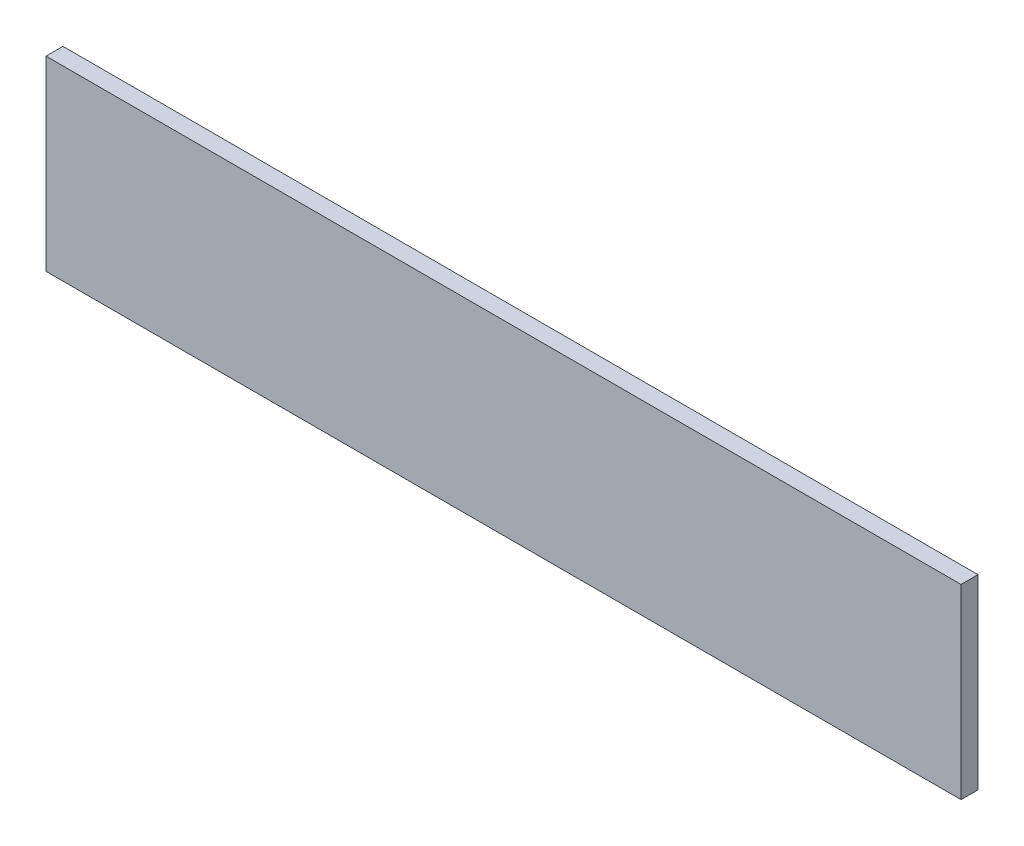
ISO-10303-21;
HEADER;
FILE_DESCRIPTION(('STEP AP214'),'2;1');
FILE_NAME('part.step','',(''),(''),'','','');
FILE_SCHEMA(('AUTOMOTIVE_DESIGN { 1 0 10303 214 1 1 1 1 }'));
ENDSEC;
DATA;
#1=APPLICATION_CONTEXT('core data for automotive mechanical design processes');
#2=APPLICATION_PROTOCOL_DEFINITION('international standard','automotive_design',2000,#1);
#3=PRODUCT_CONTEXT('',#1,'mechanical');
#4=PRODUCT('Part','Part','',(#3));
#5=PRODUCT_RELATED_PRODUCT_CATEGORY('part','',(#4));
#6=PRODUCT_DEFINITION_FORMATION('','',#4);
#7=PRODUCT_DEFINITION_CONTEXT('part definition',#1,'design');
#8=PRODUCT_DEFINITION('design','',#6,#7);
#9=PRODUCT_DEFINITION_SHAPE('','',#8);
#10=(LENGTH_UNIT() NAMED_UNIT(*) SI_UNIT(.MILLI.,.METRE.));
#11=(NAMED_UNIT(*) PLANE_ANGLE_UNIT() SI_UNIT($,.RADIAN.));
#12=(NAMED_UNIT(*) SI_UNIT($,.STERADIAN.) SOLID_ANGLE_UNIT());
#13=UNCERTAINTY_MEASURE_WITH_UNIT(LENGTH_MEASURE(1.E-05),#10,'distance_accuracy_value','');
#14=(GEOMETRIC_REPRESENTATION_CONTEXT(3) GLOBAL_UNCERTAINTY_ASSIGNED_CONTEXT((#13)) GLOBAL_UNIT_ASSIGNED_CONTEXT((#10,
#11,#12)) REPRESENTATION_CONTEXT('',''));
#15=CARTESIAN_POINT('',(0.,0.,0.));
#16=DIRECTION('',(0.,0.,1.));
#17=DIRECTION('',(1.,0.,0.));
#18=AXIS2_PLACEMENT_3D('',#15,#16,#17);
#19=CARTESIAN_POINT('',(342.9,69.85,12.7));
#20=DIRECTION('',(-1.,0.,0.));
#21=DIRECTION('',(0.,0.,1.));
#22=AXIS2_PLACEMENT_3D('',#19,#20,#21);
#23=PLANE('',#22);
#24=DIRECTION('',(0.,1.,0.));
#25=VECTOR('',#24,1.);
#26=CARTESIAN_POINT('',(342.9,69.85,0.));
#27=LINE('',#26,#25);
#28=CARTESIAN_POINT('',(342.9,-69.85,0.));
#29=VERTEX_POINT('',#28);
#30=CARTESIAN_POINT('',(342.9,69.85,0.));
#31=VERTEX_POINT('',#30);
#32=EDGE_CURVE('E107',#29,#31,#27,.T.);
#33=ORIENTED_EDGE('',*,*,#32,.T.);
#34=DIRECTION('',(0.,0.,-1.));
#35=VECTOR('',#34,1.);
#36=CARTESIAN_POINT('',(342.9,69.85,12.7));
#37=LINE('',#36,#35);
#38=CARTESIAN_POINT('',(342.9,69.85,12.7));
#39=VERTEX_POINT('',#38);
#40=EDGE_CURVE('E11',#39,#31,#37,.T.);
#41=ORIENTED_EDGE('',*,*,#40,.F.);
#42=DIRECTION('',(0.,1.,0.));
#43=VECTOR('',#42,1.);
#44=CARTESIAN_POINT('',(342.9,69.85,12.7));
#45=LINE('',#44,#43);
#46=CARTESIAN_POINT('',(342.9,-69.85,12.7));
#47=VERTEX_POINT('',#46);
#48=EDGE_CURVE('E91',#47,#39,#45,.T.);
#49=ORIENTED_EDGE('',*,*,#48,.F.);
#50=DIRECTION('',(0.,0.,-1.));
#51=VECTOR('',#50,1.);
#52=CARTESIAN_POINT('',(342.9,-69.85,12.7));
#53=LINE('',#52,#51);
#54=EDGE_CURVE('E103',#47,#29,#53,.T.);
#55=ORIENTED_EDGE('',*,*,#54,.T.);
#56=EDGE_LOOP('',(#33,#41,#49,#55));
#57=FACE_BOUND('',#56,.T.);
#58=ADVANCED_FACE('F39',(#57),#23,.F.);
#59=CARTESIAN_POINT('',(-342.9,69.85,12.7));
#60=DIRECTION('',(0.,-1.,0.));
#61=DIRECTION('',(0.,0.,-1.));
#62=AXIS2_PLACEMENT_3D('',#59,#60,#61);
#63=PLANE('',#62);
#64=DIRECTION('',(-1.,0.,0.));
#65=VECTOR('',#64,1.);
#66=CARTESIAN_POINT('',(-342.9,69.85,0.));
#67=LINE('',#66,#65);
#68=CARTESIAN_POINT('',(-342.9,69.85,0.));
#69=VERTEX_POINT('',#68);
#70=EDGE_CURVE('E96',#31,#69,#67,.T.);
#71=ORIENTED_EDGE('',*,*,#70,.T.);
#72=DIRECTION('',(0.,0.,-1.));
#73=VECTOR('',#72,1.);
#74=CARTESIAN_POINT('',(-342.9,69.85,12.7));
#75=LINE('',#74,#73);
#76=CARTESIAN_POINT('',(-342.9,69.85,12.7));
#77=VERTEX_POINT('',#76);
#78=EDGE_CURVE('E48',#77,#69,#75,.T.);
#79=ORIENTED_EDGE('',*,*,#78,.F.);
#80=DIRECTION('',(-1.,0.,0.));
#81=VECTOR('',#80,1.);
#82=CARTESIAN_POINT('',(-342.9,69.85,12.7));
#83=LINE('',#82,#81);
#84=EDGE_CURVE('E86',#39,#77,#83,.T.);
#85=ORIENTED_EDGE('',*,*,#84,.F.);
#86=ORIENTED_EDGE('',*,*,#40,.T.);
#87=EDGE_LOOP('',(#71,#79,#85,#86));
#88=FACE_BOUND('',#87,.T.);
#89=ADVANCED_FACE('F95',(#88),#63,.F.);
#90=CARTESIAN_POINT('',(-342.9,69.85,12.7));
#91=DIRECTION('',(1.,0.,0.));
#92=DIRECTION('',(0.,0.,-1.));
#93=AXIS2_PLACEMENT_3D('',#90,#91,#92);
#94=PLANE('',#93);
#95=DIRECTION('',(0.,-1.,0.));
#96=VECTOR('',#95,1.);
#97=CARTESIAN_POINT('',(-342.9,69.85,0.));
#98=LINE('',#97,#96);
#99=CARTESIAN_POINT('',(-342.9,-69.85,0.));
#100=VERTEX_POINT('',#99);
#101=EDGE_CURVE('E73',#69,#100,#98,.T.);
#102=ORIENTED_EDGE('',*,*,#101,.T.);
#103=DIRECTION('',(0.,0.,-1.));
#104=VECTOR('',#103,1.);
#105=CARTESIAN_POINT('',(-342.9,-69.85,12.7));
#106=LINE('',#105,#104);
#107=CARTESIAN_POINT('',(-342.9,-69.85,12.7));
#108=VERTEX_POINT('',#107);
#109=EDGE_CURVE('E98',#108,#100,#106,.T.);
#110=ORIENTED_EDGE('',*,*,#109,.F.);
#111=DIRECTION('',(0.,-1.,0.));
#112=VECTOR('',#111,1.);
#113=CARTESIAN_POINT('',(-342.9,69.85,12.7));
#114=LINE('',#113,#112);
#115=EDGE_CURVE('E89',#77,#108,#114,.T.);
#116=ORIENTED_EDGE('',*,*,#115,.F.);
#117=ORIENTED_EDGE('',*,*,#78,.T.);
#118=EDGE_LOOP('',(#102,#110,#116,#117));
#119=FACE_BOUND('',#118,.T.);
#120=ADVANCED_FACE('F99',(#119),#94,.F.);
#121=CARTESIAN_POINT('',(-342.9,-69.85,12.7));
#122=DIRECTION('',(0.,1.,0.));
#123=DIRECTION('',(0.,0.,1.));
#124=AXIS2_PLACEMENT_3D('',#121,#122,#123);
#125=PLANE('',#124);
#126=DIRECTION('',(1.,0.,0.));
#127=VECTOR('',#126,1.);
#128=CARTESIAN_POINT('',(-342.9,-69.85,0.));
#129=LINE('',#128,#127);
#130=EDGE_CURVE('E79',#100,#29,#129,.T.);
#131=ORIENTED_EDGE('',*,*,#130,.T.);
#132=ORIENTED_EDGE('',*,*,#54,.F.);
#133=DIRECTION('',(1.,0.,0.));
#134=VECTOR('',#133,1.);
#135=CARTESIAN_POINT('',(-342.9,-69.85,12.7));
#136=LINE('',#135,#134);
#137=EDGE_CURVE('E56',#108,#47,#136,.T.);
#138=ORIENTED_EDGE('',*,*,#137,.F.);
#139=ORIENTED_EDGE('',*,*,#109,.T.);
#140=EDGE_LOOP('',(#131,#132,#138,#139));
#141=FACE_BOUND('',#140,.T.);
#142=ADVANCED_FACE('F120',(#141),#125,.F.);
#143=CARTESIAN_POINT('',(0.,0.,12.7));
#144=DIRECTION('',(0.,0.,1.));
#145=DIRECTION('',(1.,0.,0.));
#146=AXIS2_PLACEMENT_3D('',#143,#144,#145);
#147=PLANE('',#146);
#148=ORIENTED_EDGE('',*,*,#48,.T.);
#149=ORIENTED_EDGE('',*,*,#84,.T.);
#150=ORIENTED_EDGE('',*,*,#115,.T.);
#151=ORIENTED_EDGE('',*,*,#137,.T.);
#152=EDGE_LOOP('',(#148,#149,#150,#151));
#153=FACE_BOUND('',#152,.T.);
#154=ADVANCED_FACE('F87',(#153),#147,.T.);
#155=CARTESIAN_POINT('',(0.,0.,0.));
#156=DIRECTION('',(0.,0.,1.));
#157=DIRECTION('',(1.,0.,0.));
#158=AXIS2_PLACEMENT_3D('',#155,#156,#157);
#159=PLANE('',#158);
#160=ORIENTED_EDGE('',*,*,#32,.F.);
#161=ORIENTED_EDGE('',*,*,#130,.F.);
#162=ORIENTED_EDGE('',*,*,#101,.F.);
#163=ORIENTED_EDGE('',*,*,#70,.F.);
#164=EDGE_LOOP('',(#160,#161,#162,#163));
#165=FACE_BOUND('',#164,.T.);
#166=ADVANCED_FACE('F123',(#165),#159,.F.);
#167=CLOSED_SHELL('',(#58,#89,#120,#142,#154,#166));
#168=MANIFOLD_SOLID_BREP('B2',#167);
#169=ADVANCED_BREP_SHAPE_REPRESENTATION('',(#18,#168),#14);
#170=SHAPE_DEFINITION_REPRESENTATION(#9,#169);
ENDSEC;
END-ISO-10303-21;
